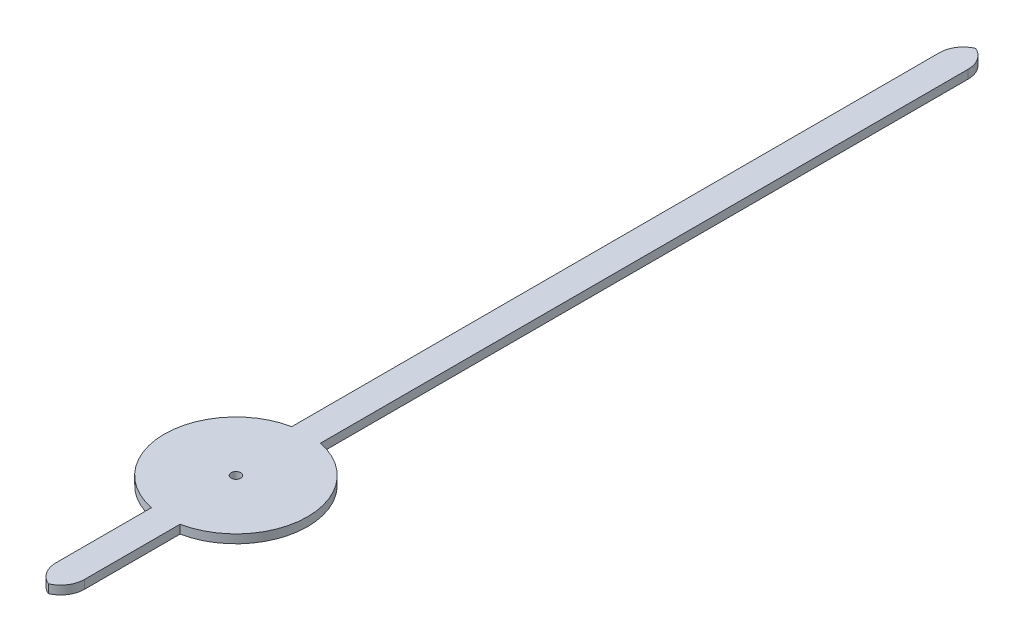
ISO-10303-21;
HEADER;
FILE_DESCRIPTION(('STEP AP214'),'2;1');
FILE_NAME('part.step','',(''),(''),'','','');
FILE_SCHEMA(('AUTOMOTIVE_DESIGN { 1 0 10303 214 1 1 1 1 }'));
ENDSEC;
DATA;
#1=APPLICATION_CONTEXT('core data for automotive mechanical design processes');
#2=APPLICATION_PROTOCOL_DEFINITION('international standard','automotive_design',2000,#1);
#3=PRODUCT_CONTEXT('',#1,'mechanical');
#4=PRODUCT('Part','Part','',(#3));
#5=PRODUCT_RELATED_PRODUCT_CATEGORY('part','',(#4));
#6=PRODUCT_DEFINITION_FORMATION('','',#4);
#7=PRODUCT_DEFINITION_CONTEXT('part definition',#1,'design');
#8=PRODUCT_DEFINITION('design','',#6,#7);
#9=PRODUCT_DEFINITION_SHAPE('','',#8);
#10=(LENGTH_UNIT() NAMED_UNIT(*) SI_UNIT(.MILLI.,.METRE.));
#11=(NAMED_UNIT(*) PLANE_ANGLE_UNIT() SI_UNIT($,.RADIAN.));
#12=(NAMED_UNIT(*) SI_UNIT($,.STERADIAN.) SOLID_ANGLE_UNIT());
#13=UNCERTAINTY_MEASURE_WITH_UNIT(LENGTH_MEASURE(1.E-05),#10,'distance_accuracy_value','');
#14=(GEOMETRIC_REPRESENTATION_CONTEXT(3) GLOBAL_UNCERTAINTY_ASSIGNED_CONTEXT((#13)) GLOBAL_UNIT_ASSIGNED_CONTEXT((#10,
#11,#12)) REPRESENTATION_CONTEXT('',''));
#15=CARTESIAN_POINT('',(0.,0.,0.));
#16=DIRECTION('',(0.,0.,1.));
#17=DIRECTION('',(1.,0.,0.));
#18=AXIS2_PLACEMENT_3D('',#15,#16,#17);
#19=CARTESIAN_POINT('',(0.,0.18,0.));
#20=DIRECTION('',(0.,1.,0.));
#21=DIRECTION('',(0.,0.,1.));
#22=AXIS2_PLACEMENT_3D('',#19,#20,#21);
#23=PLANE('',#22);
#24=CARTESIAN_POINT('',(-0.2,0.18,-15.0303061543301));
#25=DIRECTION('',(0.,1.,0.));
#26=DIRECTION('',(0.,0.,1.));
#27=AXIS2_PLACEMENT_3D('',#24,#25,#26);
#28=CIRCLE('',#27,0.5);
#29=CARTESIAN_POINT('',(0.3,0.18,-15.0303061543301));
#30=VERTEX_POINT('',#29);
#31=CARTESIAN_POINT('',(0.,0.18,-15.4885637238257));
#32=VERTEX_POINT('',#31);
#33=EDGE_CURVE('E61',#30,#32,#28,.T.);
#34=ORIENTED_EDGE('',*,*,#33,.T.);
#35=CARTESIAN_POINT('',(0.2,0.18,-15.0303061543301));
#36=DIRECTION('',(0.,1.,0.));
#37=DIRECTION('',(0.,0.,1.));
#38=AXIS2_PLACEMENT_3D('',#35,#36,#37);
#39=CIRCLE('',#38,0.5);
#40=CARTESIAN_POINT('',(-0.3,0.18,-15.0303061543301));
#41=VERTEX_POINT('',#40);
#42=EDGE_CURVE('E212',#32,#41,#39,.T.);
#43=ORIENTED_EDGE('',*,*,#42,.T.);
#44=DIRECTION('',(0.,0.,1.));
#45=VECTOR('',#44,1.);
#46=CARTESIAN_POINT('',(-0.3,0.18,-1.46969384566991));
#47=LINE('',#46,#45);
#48=CARTESIAN_POINT('',(-0.299999999999999,0.18,-1.46969384566991));
#49=VERTEX_POINT('',#48);
#50=EDGE_CURVE('E150',#41,#49,#47,.T.);
#51=ORIENTED_EDGE('',*,*,#50,.T.);
#52=CARTESIAN_POINT('',(0.,0.18,0.));
#53=DIRECTION('',(0.,1.,0.));
#54=DIRECTION('',(0.,0.,1.));
#55=AXIS2_PLACEMENT_3D('',#52,#53,#54);
#56=CIRCLE('',#55,1.5);
#57=CARTESIAN_POINT('',(-0.3,0.18,1.46969384566991));
#58=VERTEX_POINT('',#57);
#59=EDGE_CURVE('E156',#49,#58,#56,.T.);
#60=ORIENTED_EDGE('',*,*,#59,.T.);
#61=DIRECTION('',(0.,0.,1.));
#62=VECTOR('',#61,1.);
#63=CARTESIAN_POINT('',(-0.3,0.18,3.96969384566991));
#64=LINE('',#63,#62);
#65=CARTESIAN_POINT('',(-0.3,0.18,3.46969384566991));
#66=VERTEX_POINT('',#65);
#67=EDGE_CURVE('E159',#58,#66,#64,.T.);
#68=ORIENTED_EDGE('',*,*,#67,.T.);
#69=CARTESIAN_POINT('',(0.2,0.18,3.46969384566991));
#70=DIRECTION('',(0.,1.,0.));
#71=DIRECTION('',(0.,0.,1.));
#72=AXIS2_PLACEMENT_3D('',#69,#70,#71);
#73=CIRCLE('',#72,0.5);
#74=CARTESIAN_POINT('',(0.,0.18,3.92795141516549));
#75=VERTEX_POINT('',#74);
#76=EDGE_CURVE('E68',#66,#75,#73,.T.);
#77=ORIENTED_EDGE('',*,*,#76,.T.);
#78=CARTESIAN_POINT('',(-0.2,0.18,3.46969384566991));
#79=DIRECTION('',(0.,1.,0.));
#80=DIRECTION('',(0.,0.,1.));
#81=AXIS2_PLACEMENT_3D('',#78,#79,#80);
#82=CIRCLE('',#81,0.5);
#83=CARTESIAN_POINT('',(0.3,0.18,3.46969384566991));
#84=VERTEX_POINT('',#83);
#85=EDGE_CURVE('E126',#75,#84,#82,.T.);
#86=ORIENTED_EDGE('',*,*,#85,.T.);
#87=DIRECTION('',(0.,0.,-1.));
#88=VECTOR('',#87,1.);
#89=CARTESIAN_POINT('',(0.3,0.18,3.96969384566991));
#90=LINE('',#89,#88);
#91=CARTESIAN_POINT('',(0.3,0.18,1.46969384566991));
#92=VERTEX_POINT('',#91);
#93=EDGE_CURVE('E120',#84,#92,#90,.T.);
#94=ORIENTED_EDGE('',*,*,#93,.T.);
#95=CARTESIAN_POINT('',(0.,0.18,0.));
#96=DIRECTION('',(0.,1.,0.));
#97=DIRECTION('',(0.,0.,1.));
#98=AXIS2_PLACEMENT_3D('',#95,#96,#97);
#99=CIRCLE('',#98,1.5);
#100=CARTESIAN_POINT('',(0.3,0.18,-1.46969384566991));
#101=VERTEX_POINT('',#100);
#102=EDGE_CURVE('E124',#92,#101,#99,.T.);
#103=ORIENTED_EDGE('',*,*,#102,.T.);
#104=DIRECTION('',(0.,0.,-1.));
#105=VECTOR('',#104,1.);
#106=CARTESIAN_POINT('',(0.3,0.18,-1.46969384566991));
#107=LINE('',#106,#105);
#108=EDGE_CURVE('E147',#101,#30,#107,.T.);
#109=ORIENTED_EDGE('',*,*,#108,.T.);
#110=EDGE_LOOP('',(#34,#43,#51,#60,#68,#77,#86,#94,#103,#109));
#111=FACE_BOUND('',#110,.T.);
#112=CARTESIAN_POINT('',(0.,0.18,0.));
#113=DIRECTION('',(0.,1.,0.));
#114=DIRECTION('',(0.,0.,1.));
#115=AXIS2_PLACEMENT_3D('',#112,#113,#114);
#116=CIRCLE('',#115,0.1);
#117=CARTESIAN_POINT('',(0.,0.18,0.1));
#118=VERTEX_POINT('',#117);
#119=EDGE_CURVE('E166',#118,#118,#116,.T.);
#120=ORIENTED_EDGE('',*,*,#119,.F.);
#121=EDGE_LOOP('',(#120));
#122=FACE_BOUND('',#121,.T.);
#123=ADVANCED_FACE('F43',(#111,#122),#23,.T.);
#124=CARTESIAN_POINT('',(0.,0.,0.));
#125=DIRECTION('',(0.,1.,0.));
#126=DIRECTION('',(0.,0.,1.));
#127=AXIS2_PLACEMENT_3D('',#124,#125,#126);
#128=PLANE('',#127);
#129=DIRECTION('',(0.,0.,1.));
#130=VECTOR('',#129,1.);
#131=CARTESIAN_POINT('',(-0.3,0.,-1.46969384566991));
#132=LINE('',#131,#130);
#133=CARTESIAN_POINT('',(-0.3,0.,-15.0303061543301));
#134=VERTEX_POINT('',#133);
#135=CARTESIAN_POINT('',(-0.299999999999999,0.,-1.46969384566991));
#136=VERTEX_POINT('',#135);
#137=EDGE_CURVE('E173',#134,#136,#132,.T.);
#138=ORIENTED_EDGE('',*,*,#137,.F.);
#139=CARTESIAN_POINT('',(0.2,0.,-15.0303061543301));
#140=DIRECTION('',(0.,1.,0.));
#141=DIRECTION('',(0.,0.,1.));
#142=AXIS2_PLACEMENT_3D('',#139,#140,#141);
#143=CIRCLE('',#142,0.5);
#144=CARTESIAN_POINT('',(0.,0.,-15.4885637238257));
#145=VERTEX_POINT('',#144);
#146=EDGE_CURVE('E203',#134,#145,#143,.F.);
#147=ORIENTED_EDGE('',*,*,#146,.T.);
#148=CARTESIAN_POINT('',(-0.2,0.,-15.0303061543301));
#149=DIRECTION('',(0.,1.,0.));
#150=DIRECTION('',(0.,0.,1.));
#151=AXIS2_PLACEMENT_3D('',#148,#149,#150);
#152=CIRCLE('',#151,0.5);
#153=CARTESIAN_POINT('',(0.3,0.,-15.0303061543301));
#154=VERTEX_POINT('',#153);
#155=EDGE_CURVE('E200',#145,#154,#152,.F.);
#156=ORIENTED_EDGE('',*,*,#155,.T.);
#157=DIRECTION('',(0.,0.,-1.));
#158=VECTOR('',#157,1.);
#159=CARTESIAN_POINT('',(0.3,0.,-1.46969384566991));
#160=LINE('',#159,#158);
#161=CARTESIAN_POINT('',(0.3,0.,-1.46969384566991));
#162=VERTEX_POINT('',#161);
#163=EDGE_CURVE('E169',#162,#154,#160,.T.);
#164=ORIENTED_EDGE('',*,*,#163,.F.);
#165=CARTESIAN_POINT('',(0.,0.,0.));
#166=DIRECTION('',(0.,1.,0.));
#167=DIRECTION('',(0.,0.,1.));
#168=AXIS2_PLACEMENT_3D('',#165,#166,#167);
#169=CIRCLE('',#168,1.5);
#170=CARTESIAN_POINT('',(0.3,0.,1.46969384566991));
#171=VERTEX_POINT('',#170);
#172=EDGE_CURVE('E165',#171,#162,#169,.T.);
#173=ORIENTED_EDGE('',*,*,#172,.F.);
#174=DIRECTION('',(0.,0.,-1.));
#175=VECTOR('',#174,1.);
#176=CARTESIAN_POINT('',(0.3,0.,3.96969384566991));
#177=LINE('',#176,#175);
#178=CARTESIAN_POINT('',(0.3,0.,3.46969384566991));
#179=VERTEX_POINT('',#178);
#180=EDGE_CURVE('E136',#179,#171,#177,.T.);
#181=ORIENTED_EDGE('',*,*,#180,.F.);
#182=CARTESIAN_POINT('',(-0.2,0.,3.46969384566991));
#183=DIRECTION('',(0.,1.,0.));
#184=DIRECTION('',(0.,0.,1.));
#185=AXIS2_PLACEMENT_3D('',#182,#183,#184);
#186=CIRCLE('',#185,0.5);
#187=CARTESIAN_POINT('',(0.,0.,3.92795141516549));
#188=VERTEX_POINT('',#187);
#189=EDGE_CURVE('E194',#179,#188,#186,.F.);
#190=ORIENTED_EDGE('',*,*,#189,.T.);
#191=CARTESIAN_POINT('',(0.2,0.,3.46969384566991));
#192=DIRECTION('',(0.,1.,0.));
#193=DIRECTION('',(0.,0.,1.));
#194=AXIS2_PLACEMENT_3D('',#191,#192,#193);
#195=CIRCLE('',#194,0.5);
#196=CARTESIAN_POINT('',(-0.3,0.,3.46969384566991));
#197=VERTEX_POINT('',#196);
#198=EDGE_CURVE('E197',#188,#197,#195,.F.);
#199=ORIENTED_EDGE('',*,*,#198,.T.);
#200=DIRECTION('',(0.,0.,1.));
#201=VECTOR('',#200,1.);
#202=CARTESIAN_POINT('',(-0.3,0.,3.96969384566991));
#203=LINE('',#202,#201);
#204=CARTESIAN_POINT('',(-0.3,0.,1.46969384566991));
#205=VERTEX_POINT('',#204);
#206=EDGE_CURVE('E130',#205,#197,#203,.T.);
#207=ORIENTED_EDGE('',*,*,#206,.F.);
#208=CARTESIAN_POINT('',(0.,0.,0.));
#209=DIRECTION('',(0.,1.,0.));
#210=DIRECTION('',(0.,0.,1.));
#211=AXIS2_PLACEMENT_3D('',#208,#209,#210);
#212=CIRCLE('',#211,1.5);
#213=EDGE_CURVE('E176',#136,#205,#212,.T.);
#214=ORIENTED_EDGE('',*,*,#213,.F.);
#215=EDGE_LOOP('',(#138,#147,#156,#164,#173,#181,#190,#199,#207,#214));
#216=FACE_BOUND('',#215,.T.);
#217=CARTESIAN_POINT('',(0.,0.,0.));
#218=DIRECTION('',(0.,1.,0.));
#219=DIRECTION('',(0.,0.,1.));
#220=AXIS2_PLACEMENT_3D('',#217,#218,#219);
#221=CIRCLE('',#220,0.1);
#222=CARTESIAN_POINT('',(0.,0.,0.1));
#223=VERTEX_POINT('',#222);
#224=EDGE_CURVE('E223',#223,#223,#221,.T.);
#225=ORIENTED_EDGE('',*,*,#224,.T.);
#226=EDGE_LOOP('',(#225));
#227=FACE_BOUND('',#226,.T.);
#228=ADVANCED_FACE('F239',(#216,#227),#128,.F.);
#229=CARTESIAN_POINT('',(0.3,0.18,3.96969384566991));
#230=DIRECTION('',(-1.,0.,0.));
#231=DIRECTION('',(0.,0.,1.));
#232=AXIS2_PLACEMENT_3D('',#229,#230,#231);
#233=PLANE('',#232);
#234=ORIENTED_EDGE('',*,*,#93,.F.);
#235=DIRECTION('',(0.,-1.,0.));
#236=VECTOR('',#235,1.);
#237=CARTESIAN_POINT('',(0.3,0.18,3.46969384566991));
#238=LINE('',#237,#236);
#239=EDGE_CURVE('E11',#84,#179,#238,.T.);
#240=ORIENTED_EDGE('',*,*,#239,.T.);
#241=ORIENTED_EDGE('',*,*,#180,.T.);
#242=DIRECTION('',(0.,-1.,0.));
#243=VECTOR('',#242,1.);
#244=CARTESIAN_POINT('',(0.3,0.18,1.46969384566991));
#245=LINE('',#244,#243);
#246=EDGE_CURVE('E133',#92,#171,#245,.T.);
#247=ORIENTED_EDGE('',*,*,#246,.F.);
#248=EDGE_LOOP('',(#234,#240,#241,#247));
#249=FACE_BOUND('',#248,.T.);
#250=ADVANCED_FACE('F134',(#249),#233,.F.);
#251=CARTESIAN_POINT('',(0.,0.18,0.));
#252=DIRECTION('',(0.,-1.,0.));
#253=DIRECTION('',(0.,0.,-1.));
#254=AXIS2_PLACEMENT_3D('',#251,#252,#253);
#255=CYLINDRICAL_SURFACE('',#254,1.5);
#256=ORIENTED_EDGE('',*,*,#172,.T.);
#257=DIRECTION('',(0.,-1.,0.));
#258=VECTOR('',#257,1.);
#259=CARTESIAN_POINT('',(0.3,0.18,-1.46969384566991));
#260=LINE('',#259,#258);
#261=EDGE_CURVE('E141',#101,#162,#260,.T.);
#262=ORIENTED_EDGE('',*,*,#261,.F.);
#263=ORIENTED_EDGE('',*,*,#102,.F.);
#264=ORIENTED_EDGE('',*,*,#246,.T.);
#265=EDGE_LOOP('',(#256,#262,#263,#264));
#266=FACE_BOUND('',#265,.T.);
#267=ADVANCED_FACE('F143',(#266),#255,.T.);
#268=CARTESIAN_POINT('',(0.3,0.18,-1.46969384566991));
#269=DIRECTION('',(-1.,0.,0.));
#270=DIRECTION('',(0.,0.,1.));
#271=AXIS2_PLACEMENT_3D('',#268,#269,#270);
#272=PLANE('',#271);
#273=ORIENTED_EDGE('',*,*,#163,.T.);
#274=DIRECTION('',(0.,-1.,0.));
#275=VECTOR('',#274,1.);
#276=CARTESIAN_POINT('',(0.3,0.18,-15.0303061543301));
#277=LINE('',#276,#275);
#278=EDGE_CURVE('E215',#154,#30,#277,.F.);
#279=ORIENTED_EDGE('',*,*,#278,.T.);
#280=ORIENTED_EDGE('',*,*,#108,.F.);
#281=ORIENTED_EDGE('',*,*,#261,.T.);
#282=EDGE_LOOP('',(#273,#279,#280,#281));
#283=FACE_BOUND('',#282,.T.);
#284=ADVANCED_FACE('F243',(#283),#272,.F.);
#285=CARTESIAN_POINT('',(-0.3,0.18,-1.46969384566991));
#286=DIRECTION('',(1.,0.,0.));
#287=DIRECTION('',(0.,0.,-1.));
#288=AXIS2_PLACEMENT_3D('',#285,#286,#287);
#289=PLANE('',#288);
#290=ORIENTED_EDGE('',*,*,#50,.F.);
#291=DIRECTION('',(0.,-1.,0.));
#292=VECTOR('',#291,1.);
#293=CARTESIAN_POINT('',(-0.3,0.18,-15.0303061543301));
#294=LINE('',#293,#292);
#295=EDGE_CURVE('E140',#41,#134,#294,.T.);
#296=ORIENTED_EDGE('',*,*,#295,.T.);
#297=ORIENTED_EDGE('',*,*,#137,.T.);
#298=DIRECTION('',(0.,-1.,0.));
#299=VECTOR('',#298,1.);
#300=CARTESIAN_POINT('',(-0.299999999999999,0.18,-1.46969384566991));
#301=LINE('',#300,#299);
#302=EDGE_CURVE('E185',#49,#136,#301,.T.);
#303=ORIENTED_EDGE('',*,*,#302,.F.);
#304=EDGE_LOOP('',(#290,#296,#297,#303));
#305=FACE_BOUND('',#304,.T.);
#306=ADVANCED_FACE('F253',(#305),#289,.F.);
#307=CARTESIAN_POINT('',(0.,0.18,0.));
#308=DIRECTION('',(0.,-1.,0.));
#309=DIRECTION('',(0.,0.,-1.));
#310=AXIS2_PLACEMENT_3D('',#307,#308,#309);
#311=CYLINDRICAL_SURFACE('',#310,1.5);
#312=ORIENTED_EDGE('',*,*,#213,.T.);
#313=DIRECTION('',(0.,-1.,0.));
#314=VECTOR('',#313,1.);
#315=CARTESIAN_POINT('',(-0.3,0.18,1.46969384566991));
#316=LINE('',#315,#314);
#317=EDGE_CURVE('E162',#58,#205,#316,.T.);
#318=ORIENTED_EDGE('',*,*,#317,.F.);
#319=ORIENTED_EDGE('',*,*,#59,.F.);
#320=ORIENTED_EDGE('',*,*,#302,.T.);
#321=EDGE_LOOP('',(#312,#318,#319,#320));
#322=FACE_BOUND('',#321,.T.);
#323=ADVANCED_FACE('F258',(#322),#311,.T.);
#324=CARTESIAN_POINT('',(-0.3,0.18,3.96969384566991));
#325=DIRECTION('',(1.,0.,0.));
#326=DIRECTION('',(0.,0.,-1.));
#327=AXIS2_PLACEMENT_3D('',#324,#325,#326);
#328=PLANE('',#327);
#329=ORIENTED_EDGE('',*,*,#206,.T.);
#330=DIRECTION('',(0.,-1.,0.));
#331=VECTOR('',#330,1.);
#332=CARTESIAN_POINT('',(-0.3,0.18,3.46969384566991));
#333=LINE('',#332,#331);
#334=EDGE_CURVE('E53',#197,#66,#333,.F.);
#335=ORIENTED_EDGE('',*,*,#334,.T.);
#336=ORIENTED_EDGE('',*,*,#67,.F.);
#337=ORIENTED_EDGE('',*,*,#317,.T.);
#338=EDGE_LOOP('',(#329,#335,#336,#337));
#339=FACE_BOUND('',#338,.T.);
#340=ADVANCED_FACE('F261',(#339),#328,.F.);
#341=CARTESIAN_POINT('',(0.,0.18,0.));
#342=DIRECTION('',(0.,-1.,0.));
#343=DIRECTION('',(0.,0.,-1.));
#344=AXIS2_PLACEMENT_3D('',#341,#342,#343);
#345=CYLINDRICAL_SURFACE('',#344,0.1);
#346=ORIENTED_EDGE('',*,*,#119,.T.);
#347=EDGE_LOOP('',(#346));
#348=FACE_BOUND('',#347,.T.);
#349=ORIENTED_EDGE('',*,*,#224,.F.);
#350=EDGE_LOOP('',(#349));
#351=FACE_BOUND('',#350,.T.);
#352=ADVANCED_FACE('F264',(#348,#351),#345,.F.);
#353=CARTESIAN_POINT('',(-0.2,0.18,-15.0303061543301));
#354=DIRECTION('',(0.,-1.,0.));
#355=DIRECTION('',(0.,0.,-1.));
#356=AXIS2_PLACEMENT_3D('',#353,#354,#355);
#357=CYLINDRICAL_SURFACE('',#356,0.5);
#358=DIRECTION('',(0.,-1.,0.));
#359=VECTOR('',#358,1.);
#360=CARTESIAN_POINT('',(0.,0.09,-15.4885637238257));
#361=LINE('',#360,#359);
#362=EDGE_CURVE('E220',#32,#145,#361,.T.);
#363=ORIENTED_EDGE('',*,*,#362,.F.);
#364=ORIENTED_EDGE('',*,*,#33,.F.);
#365=ORIENTED_EDGE('',*,*,#278,.F.);
#366=ORIENTED_EDGE('',*,*,#155,.F.);
#367=EDGE_LOOP('',(#363,#364,#365,#366));
#368=FACE_BOUND('',#367,.T.);
#369=ADVANCED_FACE('F246',(#368),#357,.T.);
#370=CARTESIAN_POINT('',(0.2,0.18,-15.0303061543301));
#371=DIRECTION('',(0.,-1.,0.));
#372=DIRECTION('',(0.,0.,-1.));
#373=AXIS2_PLACEMENT_3D('',#370,#371,#372);
#374=CYLINDRICAL_SURFACE('',#373,0.5);
#375=ORIENTED_EDGE('',*,*,#42,.F.);
#376=ORIENTED_EDGE('',*,*,#362,.T.);
#377=ORIENTED_EDGE('',*,*,#146,.F.);
#378=ORIENTED_EDGE('',*,*,#295,.F.);
#379=EDGE_LOOP('',(#375,#376,#377,#378));
#380=FACE_BOUND('',#379,.T.);
#381=ADVANCED_FACE('F249',(#380),#374,.T.);
#382=CARTESIAN_POINT('',(-0.2,0.18,3.46969384566991));
#383=DIRECTION('',(0.,-1.,0.));
#384=DIRECTION('',(0.,0.,-1.));
#385=AXIS2_PLACEMENT_3D('',#382,#383,#384);
#386=CYLINDRICAL_SURFACE('',#385,0.5);
#387=ORIENTED_EDGE('',*,*,#239,.F.);
#388=ORIENTED_EDGE('',*,*,#85,.F.);
#389=DIRECTION('',(0.,-1.,0.));
#390=VECTOR('',#389,1.);
#391=CARTESIAN_POINT('',(0.,0.09,3.92795141516549));
#392=LINE('',#391,#390);
#393=EDGE_CURVE('E47',#188,#75,#392,.F.);
#394=ORIENTED_EDGE('',*,*,#393,.F.);
#395=ORIENTED_EDGE('',*,*,#189,.F.);
#396=EDGE_LOOP('',(#387,#388,#394,#395));
#397=FACE_BOUND('',#396,.T.);
#398=ADVANCED_FACE('F45',(#397),#386,.T.);
#399=CARTESIAN_POINT('',(0.2,0.18,3.46969384566991));
#400=DIRECTION('',(0.,-1.,0.));
#401=DIRECTION('',(0.,0.,-1.));
#402=AXIS2_PLACEMENT_3D('',#399,#400,#401);
#403=CYLINDRICAL_SURFACE('',#402,0.5);
#404=ORIENTED_EDGE('',*,*,#76,.F.);
#405=ORIENTED_EDGE('',*,*,#334,.F.);
#406=ORIENTED_EDGE('',*,*,#198,.F.);
#407=ORIENTED_EDGE('',*,*,#393,.T.);
#408=EDGE_LOOP('',(#404,#405,#406,#407));
#409=FACE_BOUND('',#408,.T.);
#410=ADVANCED_FACE('F233',(#409),#403,.T.);
#411=CLOSED_SHELL('',(#123,#228,#250,#267,#284,#306,#323,#340,#352,#369,#381,#398,#410));
#412=MANIFOLD_SOLID_BREP('B2',#411);
#413=ADVANCED_BREP_SHAPE_REPRESENTATION('',(#18,#412),#14);
#414=SHAPE_DEFINITION_REPRESENTATION(#9,#413);
ENDSEC;
END-ISO-10303-21;
